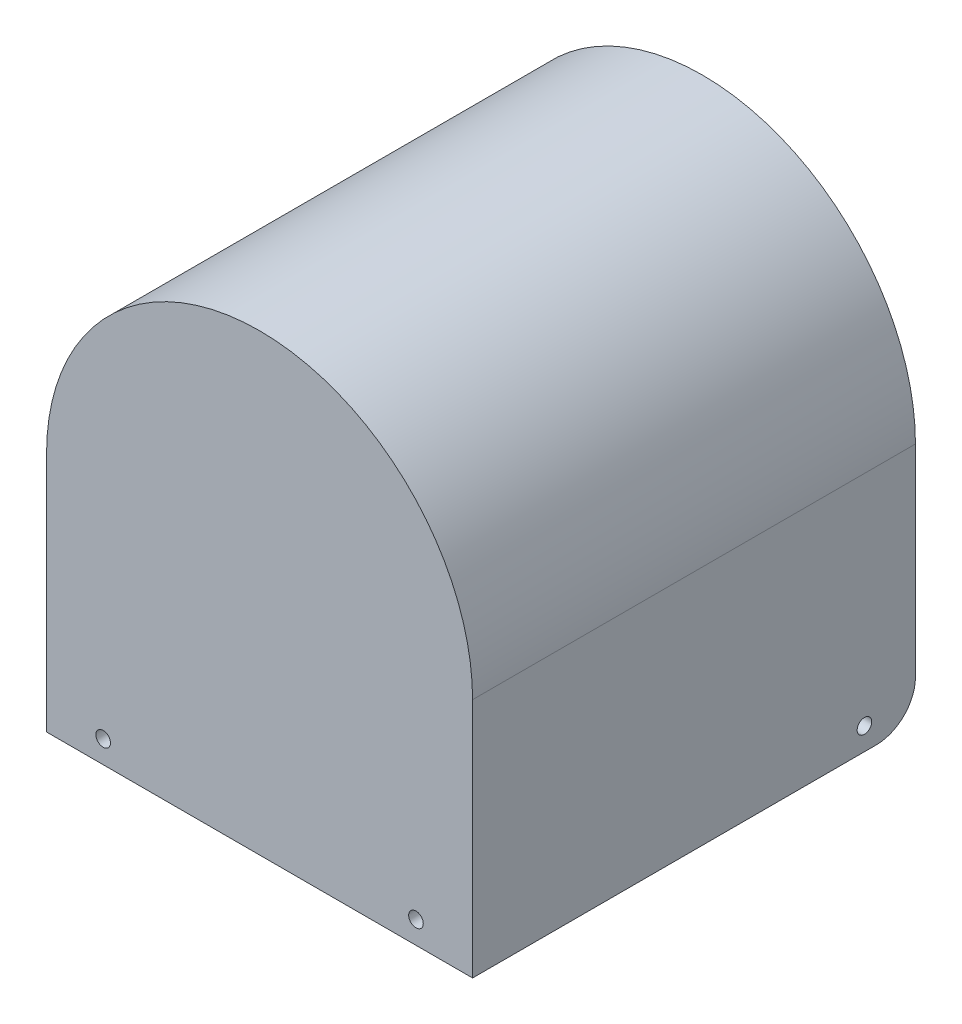
ISO-10303-21;
HEADER;
FILE_DESCRIPTION(('STEP AP214'),'2;1');
FILE_NAME('part.step','',(''),(''),'','','');
FILE_SCHEMA(('AUTOMOTIVE_DESIGN { 1 0 10303 214 1 1 1 1 }'));
ENDSEC;
DATA;
#1=APPLICATION_CONTEXT('core data for automotive mechanical design processes');
#2=APPLICATION_PROTOCOL_DEFINITION('international standard','automotive_design',2000,#1);
#3=PRODUCT_CONTEXT('',#1,'mechanical');
#4=PRODUCT('Part','Part','',(#3));
#5=PRODUCT_RELATED_PRODUCT_CATEGORY('part','',(#4));
#6=PRODUCT_DEFINITION_FORMATION('','',#4);
#7=PRODUCT_DEFINITION_CONTEXT('part definition',#1,'design');
#8=PRODUCT_DEFINITION('design','',#6,#7);
#9=PRODUCT_DEFINITION_SHAPE('','',#8);
#10=(LENGTH_UNIT() NAMED_UNIT(*) SI_UNIT(.MILLI.,.METRE.));
#11=(NAMED_UNIT(*) PLANE_ANGLE_UNIT() SI_UNIT($,.RADIAN.));
#12=(NAMED_UNIT(*) SI_UNIT($,.STERADIAN.) SOLID_ANGLE_UNIT());
#13=UNCERTAINTY_MEASURE_WITH_UNIT(LENGTH_MEASURE(1.E-05),#10,'distance_accuracy_value','');
#14=(GEOMETRIC_REPRESENTATION_CONTEXT(3) GLOBAL_UNCERTAINTY_ASSIGNED_CONTEXT((#13)) GLOBAL_UNIT_ASSIGNED_CONTEXT((#10,
#11,#12)) REPRESENTATION_CONTEXT('',''));
#15=CARTESIAN_POINT('',(0.,0.,0.));
#16=DIRECTION('',(0.,0.,1.));
#17=DIRECTION('',(1.,0.,0.));
#18=AXIS2_PLACEMENT_3D('',#15,#16,#17);
#19=CARTESIAN_POINT('',(0.,0.,79.));
#20=DIRECTION('',(0.,0.,-1.));
#21=DIRECTION('',(-1.,0.,0.));
#22=AXIS2_PLACEMENT_3D('',#19,#20,#21);
#23=CYLINDRICAL_SURFACE('',#22,36.);
#24=DIRECTION('',(0.,0.,-1.));
#25=VECTOR('',#24,1.);
#26=CARTESIAN_POINT('',(36.,0.,79.));
#27=LINE('',#26,#25);
#28=CARTESIAN_POINT('',(36.,0.,77.));
#29=VERTEX_POINT('',#28);
#30=CARTESIAN_POINT('',(36.,0.,0.));
#31=VERTEX_POINT('',#30);
#32=EDGE_CURVE('E126',#29,#31,#27,.T.);
#33=ORIENTED_EDGE('',*,*,#32,.F.);
#34=CARTESIAN_POINT('',(0.,0.,77.));
#35=DIRECTION('',(0.,0.,1.));
#36=DIRECTION('',(1.,0.,0.));
#37=AXIS2_PLACEMENT_3D('',#34,#35,#36);
#38=CIRCLE('',#37,36.);
#39=CARTESIAN_POINT('',(-36.,0.,77.));
#40=VERTEX_POINT('',#39);
#41=EDGE_CURVE('E111',#29,#40,#38,.T.);
#42=ORIENTED_EDGE('',*,*,#41,.T.);
#43=DIRECTION('',(0.,0.,-1.));
#44=VECTOR('',#43,1.);
#45=CARTESIAN_POINT('',(-36.,0.,79.));
#46=LINE('',#45,#44);
#47=CARTESIAN_POINT('',(-36.,0.,0.));
#48=VERTEX_POINT('',#47);
#49=EDGE_CURVE('E198',#40,#48,#46,.T.);
#50=ORIENTED_EDGE('',*,*,#49,.T.);
#51=CARTESIAN_POINT('',(0.,0.,0.));
#52=DIRECTION('',(0.,0.,-1.));
#53=DIRECTION('',(-1.,0.,0.));
#54=AXIS2_PLACEMENT_3D('',#51,#52,#53);
#55=CIRCLE('',#54,36.);
#56=EDGE_CURVE('E132',#48,#31,#55,.T.);
#57=ORIENTED_EDGE('',*,*,#56,.T.);
#58=EDGE_LOOP('',(#33,#42,#50,#57));
#59=FACE_BOUND('',#58,.T.);
#60=ADVANCED_FACE('F35',(#59),#23,.F.);
#61=CARTESIAN_POINT('',(36.,0.,79.));
#62=DIRECTION('',(1.,0.,0.));
#63=DIRECTION('',(0.,1.,0.));
#64=AXIS2_PLACEMENT_3D('',#61,#62,#63);
#65=PLANE('',#64);
#66=CARTESIAN_POINT('',(36.,-39.,9.1));
#67=DIRECTION('',(1.,0.,0.));
#68=DIRECTION('',(0.,1.,0.));
#69=AXIS2_PLACEMENT_3D('',#66,#67,#68);
#70=CIRCLE('',#69,1.30000000000001);
#71=CARTESIAN_POINT('',(36.,-37.7,9.1));
#72=VERTEX_POINT('',#71);
#73=EDGE_CURVE('E150',#72,#72,#70,.T.);
#74=ORIENTED_EDGE('',*,*,#73,.T.);
#75=EDGE_LOOP('',(#74));
#76=FACE_BOUND('',#75,.T.);
#77=DIRECTION('',(0.,-1.,0.));
#78=VECTOR('',#77,1.);
#79=CARTESIAN_POINT('',(36.,0.,0.));
#80=LINE('',#79,#78);
#81=CARTESIAN_POINT('',(36.,-36.,0.));
#82=VERTEX_POINT('',#81);
#83=EDGE_CURVE('E211',#31,#82,#80,.T.);
#84=ORIENTED_EDGE('',*,*,#83,.T.);
#85=CARTESIAN_POINT('',(36.,-36.,7.00000000000001));
#86=DIRECTION('',(1.,0.,0.));
#87=DIRECTION('',(0.,1.,0.));
#88=AXIS2_PLACEMENT_3D('',#85,#86,#87);
#89=CIRCLE('',#88,7.);
#90=CARTESIAN_POINT('',(36.,-43.,7.00000000000001));
#91=VERTEX_POINT('',#90);
#92=EDGE_CURVE('E11',#82,#91,#89,.F.);
#93=ORIENTED_EDGE('',*,*,#92,.T.);
#94=DIRECTION('',(0.,0.,-1.));
#95=VECTOR('',#94,1.);
#96=CARTESIAN_POINT('',(36.,-43.,79.));
#97=LINE('',#96,#95);
#98=CARTESIAN_POINT('',(36.,-43.,77.));
#99=VERTEX_POINT('',#98);
#100=EDGE_CURVE('E128',#99,#91,#97,.T.);
#101=ORIENTED_EDGE('',*,*,#100,.F.);
#102=DIRECTION('',(0.,1.,0.));
#103=VECTOR('',#102,1.);
#104=CARTESIAN_POINT('',(36.,-115.027772421476,77.));
#105=LINE('',#104,#103);
#106=EDGE_CURVE('E114',#99,#29,#105,.T.);
#107=ORIENTED_EDGE('',*,*,#106,.T.);
#108=ORIENTED_EDGE('',*,*,#32,.T.);
#109=EDGE_LOOP('',(#84,#93,#101,#107,#108));
#110=FACE_BOUND('',#109,.T.);
#111=ADVANCED_FACE('F125',(#76,#110),#65,.F.);
#112=CARTESIAN_POINT('',(38.,0.,79.));
#113=DIRECTION('',(-1.,0.,0.));
#114=DIRECTION('',(0.,-1.,0.));
#115=AXIS2_PLACEMENT_3D('',#112,#113,#114);
#116=PLANE('',#115);
#117=CARTESIAN_POINT('',(38.,-39.,9.1));
#118=DIRECTION('',(1.,0.,0.));
#119=DIRECTION('',(0.,1.,0.));
#120=AXIS2_PLACEMENT_3D('',#117,#118,#119);
#121=CIRCLE('',#120,1.30000000000001);
#122=CARTESIAN_POINT('',(38.,-37.7,9.1));
#123=VERTEX_POINT('',#122);
#124=EDGE_CURVE('E237',#123,#123,#121,.T.);
#125=ORIENTED_EDGE('',*,*,#124,.F.);
#126=EDGE_LOOP('',(#125));
#127=FACE_BOUND('',#126,.T.);
#128=DIRECTION('',(0.,0.,-1.));
#129=VECTOR('',#128,1.);
#130=CARTESIAN_POINT('',(38.,-43.,79.));
#131=LINE('',#130,#129);
#132=CARTESIAN_POINT('',(38.,-43.,79.));
#133=VERTEX_POINT('',#132);
#134=CARTESIAN_POINT('',(38.,-43.,7.00000000000001));
#135=VERTEX_POINT('',#134);
#136=EDGE_CURVE('E138',#133,#135,#131,.T.);
#137=ORIENTED_EDGE('',*,*,#136,.T.);
#138=CARTESIAN_POINT('',(38.,-36.,7.00000000000001));
#139=DIRECTION('',(-1.,0.,0.));
#140=DIRECTION('',(0.,-1.,0.));
#141=AXIS2_PLACEMENT_3D('',#138,#139,#140);
#142=CIRCLE('',#141,7.);
#143=CARTESIAN_POINT('',(38.,-36.,0.));
#144=VERTEX_POINT('',#143);
#145=EDGE_CURVE('E43',#135,#144,#142,.F.);
#146=ORIENTED_EDGE('',*,*,#145,.T.);
#147=DIRECTION('',(0.,1.,0.));
#148=VECTOR('',#147,1.);
#149=CARTESIAN_POINT('',(38.,0.,0.));
#150=LINE('',#149,#148);
#151=CARTESIAN_POINT('',(38.,0.,0.));
#152=VERTEX_POINT('',#151);
#153=EDGE_CURVE('E212',#144,#152,#150,.T.);
#154=ORIENTED_EDGE('',*,*,#153,.T.);
#155=DIRECTION('',(0.,0.,-1.));
#156=VECTOR('',#155,1.);
#157=CARTESIAN_POINT('',(38.,0.,79.));
#158=LINE('',#157,#156);
#159=CARTESIAN_POINT('',(38.,0.,79.));
#160=VERTEX_POINT('',#159);
#161=EDGE_CURVE('E203',#160,#152,#158,.T.);
#162=ORIENTED_EDGE('',*,*,#161,.F.);
#163=DIRECTION('',(0.,1.,0.));
#164=VECTOR('',#163,1.);
#165=CARTESIAN_POINT('',(38.,0.,79.));
#166=LINE('',#165,#164);
#167=EDGE_CURVE('E192',#133,#160,#166,.T.);
#168=ORIENTED_EDGE('',*,*,#167,.F.);
#169=EDGE_LOOP('',(#137,#146,#154,#162,#168));
#170=FACE_BOUND('',#169,.T.);
#171=ADVANCED_FACE('F206',(#127,#170),#116,.F.);
#172=CARTESIAN_POINT('',(0.,0.,79.));
#173=DIRECTION('',(0.,0.,-1.));
#174=DIRECTION('',(-1.,0.,0.));
#175=AXIS2_PLACEMENT_3D('',#172,#173,#174);
#176=CYLINDRICAL_SURFACE('',#175,38.);
#177=CARTESIAN_POINT('',(0.,0.,0.));
#178=DIRECTION('',(0.,0.,1.));
#179=DIRECTION('',(-1.,0.,0.));
#180=AXIS2_PLACEMENT_3D('',#177,#178,#179);
#181=CIRCLE('',#180,38.);
#182=CARTESIAN_POINT('',(-38.,0.,0.));
#183=VERTEX_POINT('',#182);
#184=EDGE_CURVE('E194',#152,#183,#181,.T.);
#185=ORIENTED_EDGE('',*,*,#184,.T.);
#186=DIRECTION('',(0.,0.,-1.));
#187=VECTOR('',#186,1.);
#188=CARTESIAN_POINT('',(-38.,0.,79.));
#189=LINE('',#188,#187);
#190=CARTESIAN_POINT('',(-38.,0.,79.));
#191=VERTEX_POINT('',#190);
#192=EDGE_CURVE('E182',#191,#183,#189,.T.);
#193=ORIENTED_EDGE('',*,*,#192,.F.);
#194=CARTESIAN_POINT('',(0.,0.,79.));
#195=DIRECTION('',(0.,0.,1.));
#196=DIRECTION('',(-1.,0.,0.));
#197=AXIS2_PLACEMENT_3D('',#194,#195,#196);
#198=CIRCLE('',#197,38.);
#199=EDGE_CURVE('E224',#160,#191,#198,.T.);
#200=ORIENTED_EDGE('',*,*,#199,.F.);
#201=ORIENTED_EDGE('',*,*,#161,.T.);
#202=EDGE_LOOP('',(#185,#193,#200,#201));
#203=FACE_BOUND('',#202,.T.);
#204=ADVANCED_FACE('F221',(#203),#176,.T.);
#205=CARTESIAN_POINT('',(-38.,0.,79.));
#206=DIRECTION('',(1.,0.,0.));
#207=DIRECTION('',(0.,1.,0.));
#208=AXIS2_PLACEMENT_3D('',#205,#206,#207);
#209=PLANE('',#208);
#210=CARTESIAN_POINT('',(-38.,-39.,9.1));
#211=DIRECTION('',(1.,0.,0.));
#212=DIRECTION('',(0.,1.,0.));
#213=AXIS2_PLACEMENT_3D('',#210,#211,#212);
#214=CIRCLE('',#213,1.30000000000001);
#215=CARTESIAN_POINT('',(-38.,-37.7,9.1));
#216=VERTEX_POINT('',#215);
#217=EDGE_CURVE('E151',#216,#216,#214,.T.);
#218=ORIENTED_EDGE('',*,*,#217,.T.);
#219=EDGE_LOOP('',(#218));
#220=FACE_BOUND('',#219,.T.);
#221=DIRECTION('',(0.,-1.,0.));
#222=VECTOR('',#221,1.);
#223=CARTESIAN_POINT('',(-38.,0.,0.));
#224=LINE('',#223,#222);
#225=CARTESIAN_POINT('',(-38.,-36.,0.));
#226=VERTEX_POINT('',#225);
#227=EDGE_CURVE('E171',#183,#226,#224,.T.);
#228=ORIENTED_EDGE('',*,*,#227,.T.);
#229=CARTESIAN_POINT('',(-38.,-36.,7.00000000000001));
#230=DIRECTION('',(1.,0.,0.));
#231=DIRECTION('',(0.,1.,0.));
#232=AXIS2_PLACEMENT_3D('',#229,#230,#231);
#233=CIRCLE('',#232,7.);
#234=CARTESIAN_POINT('',(-38.,-43.,7.00000000000001));
#235=VERTEX_POINT('',#234);
#236=EDGE_CURVE('E160',#226,#235,#233,.F.);
#237=ORIENTED_EDGE('',*,*,#236,.T.);
#238=DIRECTION('',(0.,0.,-1.));
#239=VECTOR('',#238,1.);
#240=CARTESIAN_POINT('',(-38.,-43.,79.));
#241=LINE('',#240,#239);
#242=CARTESIAN_POINT('',(-38.,-43.,79.));
#243=VERTEX_POINT('',#242);
#244=EDGE_CURVE('E168',#243,#235,#241,.T.);
#245=ORIENTED_EDGE('',*,*,#244,.F.);
#246=DIRECTION('',(0.,-1.,0.));
#247=VECTOR('',#246,1.);
#248=CARTESIAN_POINT('',(-38.,0.,79.));
#249=LINE('',#248,#247);
#250=EDGE_CURVE('E200',#191,#243,#249,.T.);
#251=ORIENTED_EDGE('',*,*,#250,.F.);
#252=ORIENTED_EDGE('',*,*,#192,.T.);
#253=EDGE_LOOP('',(#228,#237,#245,#251,#252));
#254=FACE_BOUND('',#253,.T.);
#255=ADVANCED_FACE('F166',(#220,#254),#209,.F.);
#256=CARTESIAN_POINT('',(-38.,-43.,79.));
#257=DIRECTION('',(0.,1.,0.));
#258=DIRECTION('',(0.,0.,1.));
#259=AXIS2_PLACEMENT_3D('',#256,#257,#258);
#260=PLANE('',#259);
#261=ORIENTED_EDGE('',*,*,#244,.T.);
#262=DIRECTION('',(1.,0.,0.));
#263=VECTOR('',#262,1.);
#264=CARTESIAN_POINT('',(-36.,-43.,7.00000000000001));
#265=LINE('',#264,#263);
#266=CARTESIAN_POINT('',(-36.,-43.,7.00000000000001));
#267=VERTEX_POINT('',#266);
#268=EDGE_CURVE('E136',#235,#267,#265,.T.);
#269=ORIENTED_EDGE('',*,*,#268,.T.);
#270=DIRECTION('',(0.,0.,-1.));
#271=VECTOR('',#270,1.);
#272=CARTESIAN_POINT('',(-36.,-43.,79.));
#273=LINE('',#272,#271);
#274=CARTESIAN_POINT('',(-36.,-43.,77.));
#275=VERTEX_POINT('',#274);
#276=EDGE_CURVE('E183',#275,#267,#273,.T.);
#277=ORIENTED_EDGE('',*,*,#276,.F.);
#278=DIRECTION('',(1.,0.,0.));
#279=VECTOR('',#278,1.);
#280=CARTESIAN_POINT('',(-36.,-43.,77.));
#281=LINE('',#280,#279);
#282=EDGE_CURVE('E215',#275,#99,#281,.T.);
#283=ORIENTED_EDGE('',*,*,#282,.T.);
#284=ORIENTED_EDGE('',*,*,#100,.T.);
#285=DIRECTION('',(1.,0.,0.));
#286=VECTOR('',#285,1.);
#287=CARTESIAN_POINT('',(38.,-43.,7.00000000000001));
#288=LINE('',#287,#286);
#289=EDGE_CURVE('E133',#91,#135,#288,.T.);
#290=ORIENTED_EDGE('',*,*,#289,.T.);
#291=ORIENTED_EDGE('',*,*,#136,.F.);
#292=DIRECTION('',(1.,0.,0.));
#293=VECTOR('',#292,1.);
#294=CARTESIAN_POINT('',(36.,-43.,79.));
#295=LINE('',#294,#293);
#296=EDGE_CURVE('E180',#243,#133,#295,.T.);
#297=ORIENTED_EDGE('',*,*,#296,.F.);
#298=EDGE_LOOP('',(#261,#269,#277,#283,#284,#290,#291,#297));
#299=FACE_BOUND('',#298,.T.);
#300=ADVANCED_FACE('F176',(#299),#260,.F.);
#301=CARTESIAN_POINT('',(-36.,0.,79.));
#302=DIRECTION('',(-1.,0.,0.));
#303=DIRECTION('',(0.,-1.,0.));
#304=AXIS2_PLACEMENT_3D('',#301,#302,#303);
#305=PLANE('',#304);
#306=CARTESIAN_POINT('',(-36.,-39.,9.1));
#307=DIRECTION('',(-1.,0.,0.));
#308=DIRECTION('',(0.,-1.,0.));
#309=AXIS2_PLACEMENT_3D('',#306,#307,#308);
#310=CIRCLE('',#309,1.30000000000001);
#311=CARTESIAN_POINT('',(-36.,-40.3,9.1));
#312=VERTEX_POINT('',#311);
#313=EDGE_CURVE('E148',#312,#312,#310,.T.);
#314=ORIENTED_EDGE('',*,*,#313,.T.);
#315=EDGE_LOOP('',(#314));
#316=FACE_BOUND('',#315,.T.);
#317=ORIENTED_EDGE('',*,*,#276,.T.);
#318=CARTESIAN_POINT('',(-36.,-36.,7.00000000000001));
#319=DIRECTION('',(-1.,0.,0.));
#320=DIRECTION('',(0.,-1.,0.));
#321=AXIS2_PLACEMENT_3D('',#318,#319,#320);
#322=CIRCLE('',#321,7.);
#323=CARTESIAN_POINT('',(-36.,-36.,0.));
#324=VERTEX_POINT('',#323);
#325=EDGE_CURVE('E155',#267,#324,#322,.F.);
#326=ORIENTED_EDGE('',*,*,#325,.T.);
#327=DIRECTION('',(0.,1.,0.));
#328=VECTOR('',#327,1.);
#329=CARTESIAN_POINT('',(-36.,0.,0.));
#330=LINE('',#329,#328);
#331=EDGE_CURVE('E189',#324,#48,#330,.T.);
#332=ORIENTED_EDGE('',*,*,#331,.T.);
#333=ORIENTED_EDGE('',*,*,#49,.F.);
#334=DIRECTION('',(0.,1.,0.));
#335=VECTOR('',#334,1.);
#336=CARTESIAN_POINT('',(-36.,-115.027772421476,77.));
#337=LINE('',#336,#335);
#338=EDGE_CURVE('E117',#275,#40,#337,.T.);
#339=ORIENTED_EDGE('',*,*,#338,.F.);
#340=EDGE_LOOP('',(#317,#326,#332,#333,#339));
#341=FACE_BOUND('',#340,.T.);
#342=ADVANCED_FACE('F188',(#316,#341),#305,.F.);
#343=CARTESIAN_POINT('',(0.,0.,79.));
#344=DIRECTION('',(0.,0.,-1.));
#345=DIRECTION('',(-1.,0.,0.));
#346=AXIS2_PLACEMENT_3D('',#343,#344,#345);
#347=PLANE('',#346);
#348=CARTESIAN_POINT('',(-27.9,-39.,79.));
#349=DIRECTION('',(0.,0.,1.));
#350=DIRECTION('',(1.,0.,0.));
#351=AXIS2_PLACEMENT_3D('',#348,#349,#350);
#352=CIRCLE('',#351,1.3);
#353=CARTESIAN_POINT('',(-26.6,-39.,79.));
#354=VERTEX_POINT('',#353);
#355=EDGE_CURVE('E145',#354,#354,#352,.T.);
#356=ORIENTED_EDGE('',*,*,#355,.F.);
#357=EDGE_LOOP('',(#356));
#358=FACE_BOUND('',#357,.T.);
#359=CARTESIAN_POINT('',(27.9,-39.,79.));
#360=DIRECTION('',(0.,0.,1.));
#361=DIRECTION('',(1.,0.,0.));
#362=AXIS2_PLACEMENT_3D('',#359,#360,#361);
#363=CIRCLE('',#362,1.3);
#364=CARTESIAN_POINT('',(29.2,-39.,79.));
#365=VERTEX_POINT('',#364);
#366=EDGE_CURVE('E230',#365,#365,#363,.T.);
#367=ORIENTED_EDGE('',*,*,#366,.F.);
#368=EDGE_LOOP('',(#367));
#369=FACE_BOUND('',#368,.T.);
#370=ORIENTED_EDGE('',*,*,#250,.T.);
#371=ORIENTED_EDGE('',*,*,#296,.T.);
#372=ORIENTED_EDGE('',*,*,#167,.T.);
#373=ORIENTED_EDGE('',*,*,#199,.T.);
#374=EDGE_LOOP('',(#370,#371,#372,#373));
#375=FACE_BOUND('',#374,.T.);
#376=ADVANCED_FACE('F253',(#358,#369,#375),#347,.F.);
#377=CARTESIAN_POINT('',(0.,0.,0.));
#378=DIRECTION('',(0.,0.,-1.));
#379=DIRECTION('',(-1.,0.,0.));
#380=AXIS2_PLACEMENT_3D('',#377,#378,#379);
#381=PLANE('',#380);
#382=ORIENTED_EDGE('',*,*,#331,.F.);
#383=DIRECTION('',(1.,0.,0.));
#384=VECTOR('',#383,1.);
#385=CARTESIAN_POINT('',(-38.,-36.,0.));
#386=LINE('',#385,#384);
#387=EDGE_CURVE('E158',#324,#226,#386,.F.);
#388=ORIENTED_EDGE('',*,*,#387,.T.);
#389=ORIENTED_EDGE('',*,*,#227,.F.);
#390=ORIENTED_EDGE('',*,*,#184,.F.);
#391=ORIENTED_EDGE('',*,*,#153,.F.);
#392=DIRECTION('',(1.,0.,0.));
#393=VECTOR('',#392,1.);
#394=CARTESIAN_POINT('',(36.,-36.,0.));
#395=LINE('',#394,#393);
#396=EDGE_CURVE('E50',#144,#82,#395,.F.);
#397=ORIENTED_EDGE('',*,*,#396,.T.);
#398=ORIENTED_EDGE('',*,*,#83,.F.);
#399=ORIENTED_EDGE('',*,*,#56,.F.);
#400=EDGE_LOOP('',(#382,#388,#389,#390,#391,#397,#398,#399));
#401=FACE_BOUND('',#400,.T.);
#402=ADVANCED_FACE('F190',(#401),#381,.T.);
#403=CARTESIAN_POINT('',(-36.,-115.027772421476,77.));
#404=DIRECTION('',(0.,0.,-1.));
#405=DIRECTION('',(-1.,0.,0.));
#406=AXIS2_PLACEMENT_3D('',#403,#404,#405);
#407=PLANE('',#406);
#408=CARTESIAN_POINT('',(-27.9,-39.,77.));
#409=DIRECTION('',(0.,0.,-1.));
#410=DIRECTION('',(-1.,0.,0.));
#411=AXIS2_PLACEMENT_3D('',#408,#409,#410);
#412=CIRCLE('',#411,1.3);
#413=CARTESIAN_POINT('',(-29.2,-39.,77.));
#414=VERTEX_POINT('',#413);
#415=EDGE_CURVE('E122',#414,#414,#412,.T.);
#416=ORIENTED_EDGE('',*,*,#415,.F.);
#417=EDGE_LOOP('',(#416));
#418=FACE_BOUND('',#417,.T.);
#419=CARTESIAN_POINT('',(27.9,-39.,77.));
#420=DIRECTION('',(0.,0.,-1.));
#421=DIRECTION('',(-1.,0.,0.));
#422=AXIS2_PLACEMENT_3D('',#419,#420,#421);
#423=CIRCLE('',#422,1.3);
#424=CARTESIAN_POINT('',(26.6,-39.,77.));
#425=VERTEX_POINT('',#424);
#426=EDGE_CURVE('E142',#425,#425,#423,.T.);
#427=ORIENTED_EDGE('',*,*,#426,.F.);
#428=EDGE_LOOP('',(#427));
#429=FACE_BOUND('',#428,.T.);
#430=ORIENTED_EDGE('',*,*,#282,.F.);
#431=ORIENTED_EDGE('',*,*,#338,.T.);
#432=ORIENTED_EDGE('',*,*,#41,.F.);
#433=ORIENTED_EDGE('',*,*,#106,.F.);
#434=EDGE_LOOP('',(#430,#431,#432,#433));
#435=FACE_BOUND('',#434,.T.);
#436=ADVANCED_FACE('F113',(#418,#429,#435),#407,.T.);
#437=CARTESIAN_POINT('',(27.9,-39.,69.));
#438=DIRECTION('',(0.,0.,1.));
#439=DIRECTION('',(1.,0.,0.));
#440=AXIS2_PLACEMENT_3D('',#437,#438,#439);
#441=CYLINDRICAL_SURFACE('',#440,1.3);
#442=ORIENTED_EDGE('',*,*,#426,.T.);
#443=EDGE_LOOP('',(#442));
#444=FACE_BOUND('',#443,.T.);
#445=ORIENTED_EDGE('',*,*,#366,.T.);
#446=EDGE_LOOP('',(#445));
#447=FACE_BOUND('',#446,.T.);
#448=ADVANCED_FACE('F283',(#444,#447),#441,.F.);
#449=CARTESIAN_POINT('',(-27.9,-39.,69.));
#450=DIRECTION('',(0.,0.,1.));
#451=DIRECTION('',(1.,0.,0.));
#452=AXIS2_PLACEMENT_3D('',#449,#450,#451);
#453=CYLINDRICAL_SURFACE('',#452,1.3);
#454=ORIENTED_EDGE('',*,*,#415,.T.);
#455=EDGE_LOOP('',(#454));
#456=FACE_BOUND('',#455,.T.);
#457=ORIENTED_EDGE('',*,*,#355,.T.);
#458=EDGE_LOOP('',(#457));
#459=FACE_BOUND('',#458,.T.);
#460=ADVANCED_FACE('F248',(#456,#459),#453,.F.);
#461=CARTESIAN_POINT('',(-38.,-39.,9.1));
#462=DIRECTION('',(1.,0.,0.));
#463=DIRECTION('',(0.,1.,0.));
#464=AXIS2_PLACEMENT_3D('',#461,#462,#463);
#465=CYLINDRICAL_SURFACE('',#464,1.30000000000001);
#466=ORIENTED_EDGE('',*,*,#217,.F.);
#467=EDGE_LOOP('',(#466));
#468=FACE_BOUND('',#467,.T.);
#469=ORIENTED_EDGE('',*,*,#313,.F.);
#470=EDGE_LOOP('',(#469));
#471=FACE_BOUND('',#470,.T.);
#472=ADVANCED_FACE('F244',(#468,#471),#465,.F.);
#473=ORIENTED_EDGE('',*,*,#124,.T.);
#474=EDGE_LOOP('',(#473));
#475=FACE_BOUND('',#474,.T.);
#476=ORIENTED_EDGE('',*,*,#73,.F.);
#477=EDGE_LOOP('',(#476));
#478=FACE_BOUND('',#477,.T.);
#479=ADVANCED_FACE('F247',(#475,#478),#465,.F.);
#480=CARTESIAN_POINT('',(-38.,-36.,7.00000000000001));
#481=DIRECTION('',(-1.,0.,0.));
#482=DIRECTION('',(0.,0.,1.));
#483=AXIS2_PLACEMENT_3D('',#480,#481,#482);
#484=CYLINDRICAL_SURFACE('',#483,7.);
#485=ORIENTED_EDGE('',*,*,#236,.F.);
#486=ORIENTED_EDGE('',*,*,#387,.F.);
#487=ORIENTED_EDGE('',*,*,#325,.F.);
#488=ORIENTED_EDGE('',*,*,#268,.F.);
#489=EDGE_LOOP('',(#485,#486,#487,#488));
#490=FACE_BOUND('',#489,.T.);
#491=ADVANCED_FACE('F185',(#490),#484,.T.);
#492=CARTESIAN_POINT('',(-38.,-36.,7.00000000000001));
#493=DIRECTION('',(-1.,0.,0.));
#494=DIRECTION('',(0.,0.,1.));
#495=AXIS2_PLACEMENT_3D('',#492,#493,#494);
#496=CYLINDRICAL_SURFACE('',#495,7.);
#497=ORIENTED_EDGE('',*,*,#92,.F.);
#498=ORIENTED_EDGE('',*,*,#396,.F.);
#499=ORIENTED_EDGE('',*,*,#145,.F.);
#500=ORIENTED_EDGE('',*,*,#289,.F.);
#501=EDGE_LOOP('',(#497,#498,#499,#500));
#502=FACE_BOUND('',#501,.T.);
#503=ADVANCED_FACE('F37',(#502),#496,.T.);
#504=CLOSED_SHELL('',(#60,#111,#171,#204,#255,#300,#342,#376,#402,#436,#448,#460,#472,#479,#491,#503));
#505=MANIFOLD_SOLID_BREP('B2',#504);
#506=ADVANCED_BREP_SHAPE_REPRESENTATION('',(#18,#505),#14);
#507=SHAPE_DEFINITION_REPRESENTATION(#9,#506);
ENDSEC;
END-ISO-10303-21;
